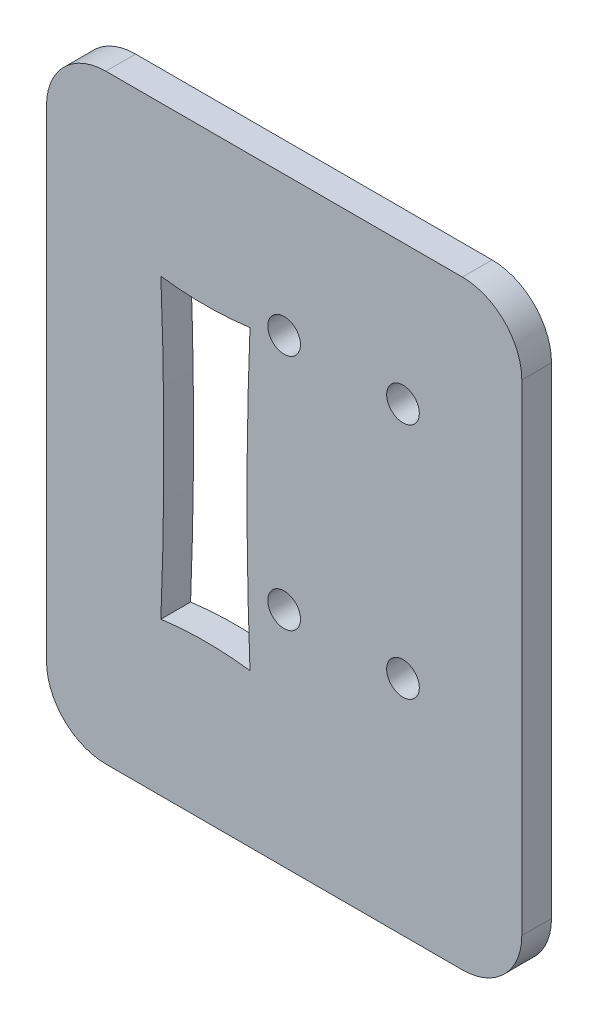
ISO-10303-21;
HEADER;
FILE_DESCRIPTION(('STEP AP214'),'2;1');
FILE_NAME('part.step','',(''),(''),'','','');
FILE_SCHEMA(('AUTOMOTIVE_DESIGN { 1 0 10303 214 1 1 1 1 }'));
ENDSEC;
DATA;
#1=APPLICATION_CONTEXT('core data for automotive mechanical design processes');
#2=APPLICATION_PROTOCOL_DEFINITION('international standard','automotive_design',2000,#1);
#3=PRODUCT_CONTEXT('',#1,'mechanical');
#4=PRODUCT('Part','Part','',(#3));
#5=PRODUCT_RELATED_PRODUCT_CATEGORY('part','',(#4));
#6=PRODUCT_DEFINITION_FORMATION('','',#4);
#7=PRODUCT_DEFINITION_CONTEXT('part definition',#1,'design');
#8=PRODUCT_DEFINITION('design','',#6,#7);
#9=PRODUCT_DEFINITION_SHAPE('','',#8);
#10=(LENGTH_UNIT() NAMED_UNIT(*) SI_UNIT(.MILLI.,.METRE.));
#11=(NAMED_UNIT(*) PLANE_ANGLE_UNIT() SI_UNIT($,.RADIAN.));
#12=(NAMED_UNIT(*) SI_UNIT($,.STERADIAN.) SOLID_ANGLE_UNIT());
#13=UNCERTAINTY_MEASURE_WITH_UNIT(LENGTH_MEASURE(1.E-05),#10,'distance_accuracy_value','');
#14=(GEOMETRIC_REPRESENTATION_CONTEXT(3) GLOBAL_UNCERTAINTY_ASSIGNED_CONTEXT((#13)) GLOBAL_UNIT_ASSIGNED_CONTEXT((#10,
#11,#12)) REPRESENTATION_CONTEXT('',''));
#15=CARTESIAN_POINT('',(0.,0.,0.));
#16=DIRECTION('',(0.,0.,1.));
#17=DIRECTION('',(1.,0.,0.));
#18=AXIS2_PLACEMENT_3D('',#15,#16,#17);
#19=CARTESIAN_POINT('',(0.,0.,2.));
#20=DIRECTION('',(0.,0.,1.));
#21=DIRECTION('',(1.,0.,0.));
#22=AXIS2_PLACEMENT_3D('',#19,#20,#21);
#23=PLANE('',#22);
#24=CARTESIAN_POINT('',(16.,31.,2.));
#25=DIRECTION('',(0.,0.,1.));
#26=DIRECTION('',(1.,0.,0.));
#27=AXIS2_PLACEMENT_3D('',#24,#25,#26);
#28=CIRCLE('',#27,1.1);
#29=CARTESIAN_POINT('',(17.1,31.,2.));
#30=VERTEX_POINT('',#29);
#31=EDGE_CURVE('E350',#30,#30,#28,.T.);
#32=ORIENTED_EDGE('',*,*,#31,.F.);
#33=EDGE_LOOP('',(#32));
#34=FACE_BOUND('',#33,.T.);
#35=CARTESIAN_POINT('',(24.,31.,2.));
#36=DIRECTION('',(0.,0.,1.));
#37=DIRECTION('',(1.,0.,0.));
#38=AXIS2_PLACEMENT_3D('',#35,#36,#37);
#39=CIRCLE('',#38,1.1);
#40=CARTESIAN_POINT('',(25.1,31.,2.));
#41=VERTEX_POINT('',#40);
#42=EDGE_CURVE('E308',#41,#41,#39,.T.);
#43=ORIENTED_EDGE('',*,*,#42,.F.);
#44=EDGE_LOOP('',(#43));
#45=FACE_BOUND('',#44,.T.);
#46=DIRECTION('',(0.,-1.,0.));
#47=VECTOR('',#46,1.);
#48=CARTESIAN_POINT('',(0.,0.,2.));
#49=LINE('',#48,#47);
#50=CARTESIAN_POINT('',(0.,36.4,2.));
#51=VERTEX_POINT('',#50);
#52=CARTESIAN_POINT('',(0.,4.,2.));
#53=VERTEX_POINT('',#52);
#54=EDGE_CURVE('E243',#51,#53,#49,.T.);
#55=ORIENTED_EDGE('',*,*,#54,.T.);
#56=CARTESIAN_POINT('',(4.,4.,2.));
#57=DIRECTION('',(0.,0.,1.));
#58=DIRECTION('',(1.,0.,0.));
#59=AXIS2_PLACEMENT_3D('',#56,#57,#58);
#60=CIRCLE('',#59,4.);
#61=CARTESIAN_POINT('',(4.,0.,2.));
#62=VERTEX_POINT('',#61);
#63=EDGE_CURVE('E216',#53,#62,#60,.T.);
#64=ORIENTED_EDGE('',*,*,#63,.T.);
#65=DIRECTION('',(1.,0.,0.));
#66=VECTOR('',#65,1.);
#67=CARTESIAN_POINT('',(0.,0.,2.));
#68=LINE('',#67,#66);
#69=CARTESIAN_POINT('',(28.,0.,2.));
#70=VERTEX_POINT('',#69);
#71=EDGE_CURVE('E272',#62,#70,#68,.T.);
#72=ORIENTED_EDGE('',*,*,#71,.T.);
#73=CARTESIAN_POINT('',(28.,4.,2.));
#74=DIRECTION('',(0.,0.,1.));
#75=DIRECTION('',(1.,0.,0.));
#76=AXIS2_PLACEMENT_3D('',#73,#74,#75);
#77=CIRCLE('',#76,4.);
#78=CARTESIAN_POINT('',(32.,4.,2.));
#79=VERTEX_POINT('',#78);
#80=EDGE_CURVE('E213',#70,#79,#77,.T.);
#81=ORIENTED_EDGE('',*,*,#80,.T.);
#82=DIRECTION('',(0.,1.,0.));
#83=VECTOR('',#82,1.);
#84=CARTESIAN_POINT('',(32.,0.,2.));
#85=LINE('',#84,#83);
#86=CARTESIAN_POINT('',(32.,36.4,2.));
#87=VERTEX_POINT('',#86);
#88=EDGE_CURVE('E231',#79,#87,#85,.T.);
#89=ORIENTED_EDGE('',*,*,#88,.T.);
#90=CARTESIAN_POINT('',(28.,36.4,2.));
#91=DIRECTION('',(0.,0.,1.));
#92=DIRECTION('',(1.,0.,0.));
#93=AXIS2_PLACEMENT_3D('',#90,#91,#92);
#94=CIRCLE('',#93,4.);
#95=CARTESIAN_POINT('',(28.,40.4,2.));
#96=VERTEX_POINT('',#95);
#97=EDGE_CURVE('E53',#87,#96,#94,.T.);
#98=ORIENTED_EDGE('',*,*,#97,.T.);
#99=DIRECTION('',(-1.,0.,0.));
#100=VECTOR('',#99,1.);
#101=CARTESIAN_POINT('',(32.,40.4,2.));
#102=LINE('',#101,#100);
#103=CARTESIAN_POINT('',(3.99999999999999,40.4,2.));
#104=VERTEX_POINT('',#103);
#105=EDGE_CURVE('E251',#96,#104,#102,.T.);
#106=ORIENTED_EDGE('',*,*,#105,.T.);
#107=CARTESIAN_POINT('',(3.99999999999999,36.4,2.));
#108=DIRECTION('',(0.,0.,1.));
#109=DIRECTION('',(1.,0.,0.));
#110=AXIS2_PLACEMENT_3D('',#107,#108,#109);
#111=CIRCLE('',#110,4.);
#112=EDGE_CURVE('E214',#104,#51,#111,.T.);
#113=ORIENTED_EDGE('',*,*,#112,.T.);
#114=EDGE_LOOP('',(#55,#64,#72,#81,#89,#98,#106,#113));
#115=FACE_BOUND('',#114,.T.);
#116=CARTESIAN_POINT('',(13.7,10.3,2.));
#117=CARTESIAN_POINT('',(13.3,20.3,2.));
#118=CARTESIAN_POINT('',(13.7,30.3,2.));
#119=B_SPLINE_CURVE_WITH_KNOTS('',2,(#116,#117,#118),.UNSPECIFIED.,.F.,.F.,(3,3),(0.,1.),.UNSPECIFIED.);
#120=CARTESIAN_POINT('',(13.7,10.3,2.));
#121=VERTEX_POINT('',#120);
#122=CARTESIAN_POINT('',(13.7,30.3,2.));
#123=VERTEX_POINT('',#122);
#124=EDGE_CURVE('E133',#121,#123,#119,.T.);
#125=ORIENTED_EDGE('',*,*,#124,.F.);
#126=CARTESIAN_POINT('',(7.7,10.3,2.));
#127=CARTESIAN_POINT('',(10.7,10.7,2.));
#128=CARTESIAN_POINT('',(13.7,10.3,2.));
#129=B_SPLINE_CURVE_WITH_KNOTS('',2,(#126,#127,#128),.UNSPECIFIED.,.F.,.F.,(3,3),(0.,1.),.UNSPECIFIED.);
#130=CARTESIAN_POINT('',(7.7,10.3,2.));
#131=VERTEX_POINT('',#130);
#132=EDGE_CURVE('E123',#131,#121,#129,.T.);
#133=ORIENTED_EDGE('',*,*,#132,.F.);
#134=CARTESIAN_POINT('',(7.7,30.3,2.));
#135=CARTESIAN_POINT('',(8.1,20.3,2.));
#136=CARTESIAN_POINT('',(7.7,10.3,2.));
#137=B_SPLINE_CURVE_WITH_KNOTS('',2,(#134,#135,#136),.UNSPECIFIED.,.F.,.F.,(3,3),(0.,1.),.UNSPECIFIED.);
#138=CARTESIAN_POINT('',(7.7,30.3,2.));
#139=VERTEX_POINT('',#138);
#140=EDGE_CURVE('E149',#139,#131,#137,.T.);
#141=ORIENTED_EDGE('',*,*,#140,.F.);
#142=CARTESIAN_POINT('',(13.7,30.3,2.));
#143=CARTESIAN_POINT('',(10.7,29.9,2.));
#144=CARTESIAN_POINT('',(7.7,30.3,2.));
#145=B_SPLINE_CURVE_WITH_KNOTS('',2,(#142,#143,#144),.UNSPECIFIED.,.F.,.F.,(3,3),(0.,1.),.UNSPECIFIED.);
#146=EDGE_CURVE('E147',#123,#139,#145,.T.);
#147=ORIENTED_EDGE('',*,*,#146,.F.);
#148=EDGE_LOOP('',(#125,#133,#141,#147));
#149=FACE_BOUND('',#148,.T.);
#150=CARTESIAN_POINT('',(24.,15.,2.));
#151=DIRECTION('',(0.,0.,1.));
#152=DIRECTION('',(1.,0.,0.));
#153=AXIS2_PLACEMENT_3D('',#150,#151,#152);
#154=CIRCLE('',#153,1.1);
#155=CARTESIAN_POINT('',(25.1,15.,2.));
#156=VERTEX_POINT('',#155);
#157=EDGE_CURVE('E356',#156,#156,#154,.T.);
#158=ORIENTED_EDGE('',*,*,#157,.F.);
#159=EDGE_LOOP('',(#158));
#160=FACE_BOUND('',#159,.T.);
#161=CARTESIAN_POINT('',(16.,15.,2.));
#162=DIRECTION('',(0.,0.,1.));
#163=DIRECTION('',(1.,0.,0.));
#164=AXIS2_PLACEMENT_3D('',#161,#162,#163);
#165=CIRCLE('',#164,1.1);
#166=CARTESIAN_POINT('',(17.1,15.,2.));
#167=VERTEX_POINT('',#166);
#168=EDGE_CURVE('E341',#167,#167,#165,.T.);
#169=ORIENTED_EDGE('',*,*,#168,.F.);
#170=EDGE_LOOP('',(#169));
#171=FACE_BOUND('',#170,.T.);
#172=ADVANCED_FACE('F32',(#34,#45,#115,#149,#160,#171),#23,.T.);
#173=CARTESIAN_POINT('',(0.,0.,0.));
#174=DIRECTION('',(0.,0.,1.));
#175=DIRECTION('',(1.,0.,0.));
#176=AXIS2_PLACEMENT_3D('',#173,#174,#175);
#177=PLANE('',#176);
#178=CARTESIAN_POINT('',(16.,31.,0.));
#179=DIRECTION('',(0.,0.,1.));
#180=DIRECTION('',(1.,0.,0.));
#181=AXIS2_PLACEMENT_3D('',#178,#179,#180);
#182=CIRCLE('',#181,1.1);
#183=CARTESIAN_POINT('',(17.1,31.,0.));
#184=VERTEX_POINT('',#183);
#185=EDGE_CURVE('E347',#184,#184,#182,.T.);
#186=ORIENTED_EDGE('',*,*,#185,.T.);
#187=EDGE_LOOP('',(#186));
#188=FACE_BOUND('',#187,.T.);
#189=CARTESIAN_POINT('',(24.,31.,0.));
#190=DIRECTION('',(0.,0.,1.));
#191=DIRECTION('',(1.,0.,0.));
#192=AXIS2_PLACEMENT_3D('',#189,#190,#191);
#193=CIRCLE('',#192,1.1);
#194=CARTESIAN_POINT('',(25.1,31.,0.));
#195=VERTEX_POINT('',#194);
#196=EDGE_CURVE('E359',#195,#195,#193,.T.);
#197=ORIENTED_EDGE('',*,*,#196,.T.);
#198=EDGE_LOOP('',(#197));
#199=FACE_BOUND('',#198,.T.);
#200=DIRECTION('',(1.,0.,0.));
#201=VECTOR('',#200,1.);
#202=CARTESIAN_POINT('',(0.,0.,0.));
#203=LINE('',#202,#201);
#204=CARTESIAN_POINT('',(4.,0.,0.));
#205=VERTEX_POINT('',#204);
#206=CARTESIAN_POINT('',(28.,0.,0.));
#207=VERTEX_POINT('',#206);
#208=EDGE_CURVE('E241',#205,#207,#203,.T.);
#209=ORIENTED_EDGE('',*,*,#208,.F.);
#210=CARTESIAN_POINT('',(4.,4.,0.));
#211=DIRECTION('',(0.,0.,1.));
#212=DIRECTION('',(1.,0.,0.));
#213=AXIS2_PLACEMENT_3D('',#210,#211,#212);
#214=CIRCLE('',#213,4.);
#215=CARTESIAN_POINT('',(0.,4.,0.));
#216=VERTEX_POINT('',#215);
#217=EDGE_CURVE('E258',#205,#216,#214,.F.);
#218=ORIENTED_EDGE('',*,*,#217,.T.);
#219=DIRECTION('',(0.,-1.,0.));
#220=VECTOR('',#219,1.);
#221=CARTESIAN_POINT('',(0.,0.,0.));
#222=LINE('',#221,#220);
#223=CARTESIAN_POINT('',(0.,36.4,0.));
#224=VERTEX_POINT('',#223);
#225=EDGE_CURVE('E141',#224,#216,#222,.T.);
#226=ORIENTED_EDGE('',*,*,#225,.F.);
#227=CARTESIAN_POINT('',(3.99999999999999,36.4,0.));
#228=DIRECTION('',(0.,0.,1.));
#229=DIRECTION('',(1.,0.,0.));
#230=AXIS2_PLACEMENT_3D('',#227,#228,#229);
#231=CIRCLE('',#230,4.);
#232=CARTESIAN_POINT('',(3.99999999999999,40.4,0.));
#233=VERTEX_POINT('',#232);
#234=EDGE_CURVE('E254',#224,#233,#231,.F.);
#235=ORIENTED_EDGE('',*,*,#234,.T.);
#236=DIRECTION('',(-1.,0.,0.));
#237=VECTOR('',#236,1.);
#238=CARTESIAN_POINT('',(32.,40.4,0.));
#239=LINE('',#238,#237);
#240=CARTESIAN_POINT('',(28.,40.4,0.));
#241=VERTEX_POINT('',#240);
#242=EDGE_CURVE('E240',#241,#233,#239,.T.);
#243=ORIENTED_EDGE('',*,*,#242,.F.);
#244=CARTESIAN_POINT('',(28.,36.4,0.));
#245=DIRECTION('',(0.,0.,1.));
#246=DIRECTION('',(1.,0.,0.));
#247=AXIS2_PLACEMENT_3D('',#244,#245,#246);
#248=CIRCLE('',#247,4.);
#249=CARTESIAN_POINT('',(32.,36.4,0.));
#250=VERTEX_POINT('',#249);
#251=EDGE_CURVE('E239',#241,#250,#248,.F.);
#252=ORIENTED_EDGE('',*,*,#251,.T.);
#253=DIRECTION('',(0.,1.,0.));
#254=VECTOR('',#253,1.);
#255=CARTESIAN_POINT('',(32.,0.,0.));
#256=LINE('',#255,#254);
#257=CARTESIAN_POINT('',(32.,4.,0.));
#258=VERTEX_POINT('',#257);
#259=EDGE_CURVE('E230',#258,#250,#256,.T.);
#260=ORIENTED_EDGE('',*,*,#259,.F.);
#261=CARTESIAN_POINT('',(28.,4.,0.));
#262=DIRECTION('',(0.,0.,1.));
#263=DIRECTION('',(1.,0.,0.));
#264=AXIS2_PLACEMENT_3D('',#261,#262,#263);
#265=CIRCLE('',#264,4.);
#266=EDGE_CURVE('E236',#258,#207,#265,.F.);
#267=ORIENTED_EDGE('',*,*,#266,.T.);
#268=EDGE_LOOP('',(#209,#218,#226,#235,#243,#252,#260,#267));
#269=FACE_BOUND('',#268,.T.);
#270=CARTESIAN_POINT('',(7.7,10.3,0.));
#271=CARTESIAN_POINT('',(10.7,10.7,0.));
#272=CARTESIAN_POINT('',(13.7,10.3,0.));
#273=B_SPLINE_CURVE_WITH_KNOTS('',2,(#270,#271,#272),.UNSPECIFIED.,.F.,.F.,(3,3),(0.,1.),.UNSPECIFIED.);
#274=CARTESIAN_POINT('',(7.7,10.3,0.));
#275=VERTEX_POINT('',#274);
#276=CARTESIAN_POINT('',(13.7,10.3,0.));
#277=VERTEX_POINT('',#276);
#278=EDGE_CURVE('E302',#275,#277,#273,.T.);
#279=ORIENTED_EDGE('',*,*,#278,.T.);
#280=CARTESIAN_POINT('',(13.7,10.3,0.));
#281=CARTESIAN_POINT('',(13.3,20.3,0.));
#282=CARTESIAN_POINT('',(13.7,30.3,0.));
#283=B_SPLINE_CURVE_WITH_KNOTS('',2,(#280,#281,#282),.UNSPECIFIED.,.F.,.F.,(3,3),(0.,1.),.UNSPECIFIED.);
#284=CARTESIAN_POINT('',(13.7,30.3,0.));
#285=VERTEX_POINT('',#284);
#286=EDGE_CURVE('E140',#277,#285,#283,.T.);
#287=ORIENTED_EDGE('',*,*,#286,.T.);
#288=CARTESIAN_POINT('',(13.7,30.3,0.));
#289=CARTESIAN_POINT('',(10.7,29.9,0.));
#290=CARTESIAN_POINT('',(7.7,30.3,0.));
#291=B_SPLINE_CURVE_WITH_KNOTS('',2,(#288,#289,#290),.UNSPECIFIED.,.F.,.F.,(3,3),(0.,1.),.UNSPECIFIED.);
#292=CARTESIAN_POINT('',(7.7,30.3,0.));
#293=VERTEX_POINT('',#292);
#294=EDGE_CURVE('E288',#285,#293,#291,.T.);
#295=ORIENTED_EDGE('',*,*,#294,.T.);
#296=CARTESIAN_POINT('',(7.7,30.3,0.));
#297=CARTESIAN_POINT('',(8.1,20.3,0.));
#298=CARTESIAN_POINT('',(7.7,10.3,0.));
#299=B_SPLINE_CURVE_WITH_KNOTS('',2,(#296,#297,#298),.UNSPECIFIED.,.F.,.F.,(3,3),(0.,1.),.UNSPECIFIED.);
#300=EDGE_CURVE('E134',#293,#275,#299,.T.);
#301=ORIENTED_EDGE('',*,*,#300,.T.);
#302=EDGE_LOOP('',(#279,#287,#295,#301));
#303=FACE_BOUND('',#302,.T.);
#304=CARTESIAN_POINT('',(24.,15.,0.));
#305=DIRECTION('',(0.,0.,1.));
#306=DIRECTION('',(1.,0.,0.));
#307=AXIS2_PLACEMENT_3D('',#304,#305,#306);
#308=CIRCLE('',#307,1.1);
#309=CARTESIAN_POINT('',(25.1,15.,0.));
#310=VERTEX_POINT('',#309);
#311=EDGE_CURVE('E353',#310,#310,#308,.T.);
#312=ORIENTED_EDGE('',*,*,#311,.T.);
#313=EDGE_LOOP('',(#312));
#314=FACE_BOUND('',#313,.T.);
#315=CARTESIAN_POINT('',(16.,15.,0.));
#316=DIRECTION('',(0.,0.,1.));
#317=DIRECTION('',(1.,0.,0.));
#318=AXIS2_PLACEMENT_3D('',#315,#316,#317);
#319=CIRCLE('',#318,1.1);
#320=CARTESIAN_POINT('',(17.1,15.,0.));
#321=VERTEX_POINT('',#320);
#322=EDGE_CURVE('E344',#321,#321,#319,.T.);
#323=ORIENTED_EDGE('',*,*,#322,.T.);
#324=EDGE_LOOP('',(#323));
#325=FACE_BOUND('',#324,.T.);
#326=ADVANCED_FACE('F176',(#188,#199,#269,#303,#314,#325),#177,.F.);
#327=CARTESIAN_POINT('',(0.,0.,2.));
#328=DIRECTION('',(1.,0.,0.));
#329=DIRECTION('',(0.,1.,0.));
#330=AXIS2_PLACEMENT_3D('',#327,#328,#329);
#331=PLANE('',#330);
#332=ORIENTED_EDGE('',*,*,#225,.T.);
#333=DIRECTION('',(0.,0.,-1.));
#334=VECTOR('',#333,1.);
#335=CARTESIAN_POINT('',(0.,4.,2.));
#336=LINE('',#335,#334);
#337=EDGE_CURVE('E218',#216,#53,#336,.F.);
#338=ORIENTED_EDGE('',*,*,#337,.T.);
#339=ORIENTED_EDGE('',*,*,#54,.F.);
#340=DIRECTION('',(0.,0.,-1.));
#341=VECTOR('',#340,1.);
#342=CARTESIAN_POINT('',(0.,36.4,2.));
#343=LINE('',#342,#341);
#344=EDGE_CURVE('E260',#51,#224,#343,.T.);
#345=ORIENTED_EDGE('',*,*,#344,.T.);
#346=EDGE_LOOP('',(#332,#338,#339,#345));
#347=FACE_BOUND('',#346,.T.);
#348=ADVANCED_FACE('F180',(#347),#331,.F.);
#349=CARTESIAN_POINT('',(0.,0.,2.));
#350=DIRECTION('',(0.,1.,0.));
#351=DIRECTION('',(0.,0.,1.));
#352=AXIS2_PLACEMENT_3D('',#349,#350,#351);
#353=PLANE('',#352);
#354=ORIENTED_EDGE('',*,*,#71,.F.);
#355=DIRECTION('',(0.,0.,-1.));
#356=VECTOR('',#355,1.);
#357=CARTESIAN_POINT('',(4.,0.,2.));
#358=LINE('',#357,#356);
#359=EDGE_CURVE('E250',#62,#205,#358,.T.);
#360=ORIENTED_EDGE('',*,*,#359,.T.);
#361=ORIENTED_EDGE('',*,*,#208,.T.);
#362=DIRECTION('',(0.,0.,-1.));
#363=VECTOR('',#362,1.);
#364=CARTESIAN_POINT('',(28.,0.,2.));
#365=LINE('',#364,#363);
#366=EDGE_CURVE('E248',#207,#70,#365,.F.);
#367=ORIENTED_EDGE('',*,*,#366,.T.);
#368=EDGE_LOOP('',(#354,#360,#361,#367));
#369=FACE_BOUND('',#368,.T.);
#370=ADVANCED_FACE('F187',(#369),#353,.F.);
#371=CARTESIAN_POINT('',(32.,0.,2.));
#372=DIRECTION('',(-1.,0.,0.));
#373=DIRECTION('',(0.,-1.,0.));
#374=AXIS2_PLACEMENT_3D('',#371,#372,#373);
#375=PLANE('',#374);
#376=ORIENTED_EDGE('',*,*,#88,.F.);
#377=DIRECTION('',(0.,0.,-1.));
#378=VECTOR('',#377,1.);
#379=CARTESIAN_POINT('',(32.,4.,2.));
#380=LINE('',#379,#378);
#381=EDGE_CURVE('E224',#79,#258,#380,.T.);
#382=ORIENTED_EDGE('',*,*,#381,.T.);
#383=ORIENTED_EDGE('',*,*,#259,.T.);
#384=DIRECTION('',(0.,0.,-1.));
#385=VECTOR('',#384,1.);
#386=CARTESIAN_POINT('',(32.,36.4,2.));
#387=LINE('',#386,#385);
#388=EDGE_CURVE('E212',#250,#87,#387,.F.);
#389=ORIENTED_EDGE('',*,*,#388,.T.);
#390=EDGE_LOOP('',(#376,#382,#383,#389));
#391=FACE_BOUND('',#390,.T.);
#392=ADVANCED_FACE('F184',(#391),#375,.F.);
#393=CARTESIAN_POINT('',(32.,40.4,2.));
#394=DIRECTION('',(0.,-1.,0.));
#395=DIRECTION('',(0.,0.,-1.));
#396=AXIS2_PLACEMENT_3D('',#393,#394,#395);
#397=PLANE('',#396);
#398=ORIENTED_EDGE('',*,*,#105,.F.);
#399=DIRECTION('',(0.,0.,-1.));
#400=VECTOR('',#399,1.);
#401=CARTESIAN_POINT('',(28.,40.4,2.));
#402=LINE('',#401,#400);
#403=EDGE_CURVE('E11',#96,#241,#402,.T.);
#404=ORIENTED_EDGE('',*,*,#403,.T.);
#405=ORIENTED_EDGE('',*,*,#242,.T.);
#406=DIRECTION('',(0.,0.,-1.));
#407=VECTOR('',#406,1.);
#408=CARTESIAN_POINT('',(3.99999999999999,40.4,2.));
#409=LINE('',#408,#407);
#410=EDGE_CURVE('E40',#233,#104,#409,.F.);
#411=ORIENTED_EDGE('',*,*,#410,.T.);
#412=EDGE_LOOP('',(#398,#404,#405,#411));
#413=FACE_BOUND('',#412,.T.);
#414=ADVANCED_FACE('F173',(#413),#397,.F.);
#415=DIRECTION('',(0.,0.,-1.));
#416=VECTOR('',#415,1.);
#417=SURFACE_OF_LINEAR_EXTRUSION('',#129,#416);
#418=ORIENTED_EDGE('',*,*,#278,.F.);
#419=DIRECTION('',(0.,0.,-1.));
#420=VECTOR('',#419,1.);
#421=CARTESIAN_POINT('',(7.7,10.3,2.));
#422=LINE('',#421,#420);
#423=EDGE_CURVE('E129',#131,#275,#422,.T.);
#424=ORIENTED_EDGE('',*,*,#423,.F.);
#425=ORIENTED_EDGE('',*,*,#132,.T.);
#426=DIRECTION('',(0.,0.,-1.));
#427=VECTOR('',#426,1.);
#428=CARTESIAN_POINT('',(13.7,10.3,2.));
#429=LINE('',#428,#427);
#430=EDGE_CURVE('E126',#121,#277,#429,.T.);
#431=ORIENTED_EDGE('',*,*,#430,.T.);
#432=EDGE_LOOP('',(#418,#424,#425,#431));
#433=FACE_BOUND('',#432,.T.);
#434=ADVANCED_FACE('F125',(#433),#417,.T.);
#435=DIRECTION('',(0.,0.,-1.));
#436=VECTOR('',#435,1.);
#437=SURFACE_OF_LINEAR_EXTRUSION('',#119,#436);
#438=ORIENTED_EDGE('',*,*,#286,.F.);
#439=ORIENTED_EDGE('',*,*,#430,.F.);
#440=ORIENTED_EDGE('',*,*,#124,.T.);
#441=DIRECTION('',(0.,0.,-1.));
#442=VECTOR('',#441,1.);
#443=CARTESIAN_POINT('',(13.7,30.3,2.));
#444=LINE('',#443,#442);
#445=EDGE_CURVE('E142',#123,#285,#444,.T.);
#446=ORIENTED_EDGE('',*,*,#445,.T.);
#447=EDGE_LOOP('',(#438,#439,#440,#446));
#448=FACE_BOUND('',#447,.T.);
#449=ADVANCED_FACE('F137',(#448),#437,.T.);
#450=DIRECTION('',(0.,0.,-1.));
#451=VECTOR('',#450,1.);
#452=SURFACE_OF_LINEAR_EXTRUSION('',#145,#451);
#453=ORIENTED_EDGE('',*,*,#294,.F.);
#454=ORIENTED_EDGE('',*,*,#445,.F.);
#455=ORIENTED_EDGE('',*,*,#146,.T.);
#456=DIRECTION('',(0.,0.,-1.));
#457=VECTOR('',#456,1.);
#458=CARTESIAN_POINT('',(7.7,30.3,2.));
#459=LINE('',#458,#457);
#460=EDGE_CURVE('E281',#139,#293,#459,.T.);
#461=ORIENTED_EDGE('',*,*,#460,.T.);
#462=EDGE_LOOP('',(#453,#454,#455,#461));
#463=FACE_BOUND('',#462,.T.);
#464=ADVANCED_FACE('F169',(#463),#452,.T.);
#465=DIRECTION('',(0.,0.,-1.));
#466=VECTOR('',#465,1.);
#467=SURFACE_OF_LINEAR_EXTRUSION('',#137,#466);
#468=ORIENTED_EDGE('',*,*,#300,.F.);
#469=ORIENTED_EDGE('',*,*,#460,.F.);
#470=ORIENTED_EDGE('',*,*,#140,.T.);
#471=ORIENTED_EDGE('',*,*,#423,.T.);
#472=EDGE_LOOP('',(#468,#469,#470,#471));
#473=FACE_BOUND('',#472,.T.);
#474=ADVANCED_FACE('F318',(#473),#467,.T.);
#475=CARTESIAN_POINT('',(24.,31.,2.));
#476=DIRECTION('',(0.,0.,-1.));
#477=DIRECTION('',(-1.,0.,0.));
#478=AXIS2_PLACEMENT_3D('',#475,#476,#477);
#479=CYLINDRICAL_SURFACE('',#478,1.1);
#480=ORIENTED_EDGE('',*,*,#42,.T.);
#481=EDGE_LOOP('',(#480));
#482=FACE_BOUND('',#481,.T.);
#483=ORIENTED_EDGE('',*,*,#196,.F.);
#484=EDGE_LOOP('',(#483));
#485=FACE_BOUND('',#484,.T.);
#486=ADVANCED_FACE('F321',(#482,#485),#479,.F.);
#487=CARTESIAN_POINT('',(24.,15.,2.));
#488=DIRECTION('',(0.,0.,-1.));
#489=DIRECTION('',(-1.,0.,0.));
#490=AXIS2_PLACEMENT_3D('',#487,#488,#489);
#491=CYLINDRICAL_SURFACE('',#490,1.1);
#492=ORIENTED_EDGE('',*,*,#157,.T.);
#493=EDGE_LOOP('',(#492));
#494=FACE_BOUND('',#493,.T.);
#495=ORIENTED_EDGE('',*,*,#311,.F.);
#496=EDGE_LOOP('',(#495));
#497=FACE_BOUND('',#496,.T.);
#498=ADVANCED_FACE('F325',(#494,#497),#491,.F.);
#499=CARTESIAN_POINT('',(16.,31.,2.));
#500=DIRECTION('',(0.,0.,-1.));
#501=DIRECTION('',(-1.,0.,0.));
#502=AXIS2_PLACEMENT_3D('',#499,#500,#501);
#503=CYLINDRICAL_SURFACE('',#502,1.1);
#504=ORIENTED_EDGE('',*,*,#31,.T.);
#505=EDGE_LOOP('',(#504));
#506=FACE_BOUND('',#505,.T.);
#507=ORIENTED_EDGE('',*,*,#185,.F.);
#508=EDGE_LOOP('',(#507));
#509=FACE_BOUND('',#508,.T.);
#510=ADVANCED_FACE('F329',(#506,#509),#503,.F.);
#511=CARTESIAN_POINT('',(16.,15.,2.));
#512=DIRECTION('',(0.,0.,-1.));
#513=DIRECTION('',(-1.,0.,0.));
#514=AXIS2_PLACEMENT_3D('',#511,#512,#513);
#515=CYLINDRICAL_SURFACE('',#514,1.1);
#516=ORIENTED_EDGE('',*,*,#168,.T.);
#517=EDGE_LOOP('',(#516));
#518=FACE_BOUND('',#517,.T.);
#519=ORIENTED_EDGE('',*,*,#322,.F.);
#520=EDGE_LOOP('',(#519));
#521=FACE_BOUND('',#520,.T.);
#522=ADVANCED_FACE('F199',(#518,#521),#515,.F.);
#523=CARTESIAN_POINT('',(4.,4.,2.));
#524=DIRECTION('',(0.,0.,-1.));
#525=DIRECTION('',(-1.,0.,0.));
#526=AXIS2_PLACEMENT_3D('',#523,#524,#525);
#527=CYLINDRICAL_SURFACE('',#526,4.);
#528=ORIENTED_EDGE('',*,*,#63,.F.);
#529=ORIENTED_EDGE('',*,*,#337,.F.);
#530=ORIENTED_EDGE('',*,*,#217,.F.);
#531=ORIENTED_EDGE('',*,*,#359,.F.);
#532=EDGE_LOOP('',(#528,#529,#530,#531));
#533=FACE_BOUND('',#532,.T.);
#534=ADVANCED_FACE('F195',(#533),#527,.T.);
#535=CARTESIAN_POINT('',(28.,4.,2.));
#536=DIRECTION('',(0.,0.,-1.));
#537=DIRECTION('',(-1.,0.,0.));
#538=AXIS2_PLACEMENT_3D('',#535,#536,#537);
#539=CYLINDRICAL_SURFACE('',#538,4.);
#540=ORIENTED_EDGE('',*,*,#80,.F.);
#541=ORIENTED_EDGE('',*,*,#366,.F.);
#542=ORIENTED_EDGE('',*,*,#266,.F.);
#543=ORIENTED_EDGE('',*,*,#381,.F.);
#544=EDGE_LOOP('',(#540,#541,#542,#543));
#545=FACE_BOUND('',#544,.T.);
#546=ADVANCED_FACE('F198',(#545),#539,.T.);
#547=CARTESIAN_POINT('',(28.,36.4,2.));
#548=DIRECTION('',(0.,0.,-1.));
#549=DIRECTION('',(-1.,0.,0.));
#550=AXIS2_PLACEMENT_3D('',#547,#548,#549);
#551=CYLINDRICAL_SURFACE('',#550,4.);
#552=ORIENTED_EDGE('',*,*,#97,.F.);
#553=ORIENTED_EDGE('',*,*,#388,.F.);
#554=ORIENTED_EDGE('',*,*,#251,.F.);
#555=ORIENTED_EDGE('',*,*,#403,.F.);
#556=EDGE_LOOP('',(#552,#553,#554,#555));
#557=FACE_BOUND('',#556,.T.);
#558=ADVANCED_FACE('F202',(#557),#551,.T.);
#559=CARTESIAN_POINT('',(3.99999999999999,36.4,2.));
#560=DIRECTION('',(0.,0.,-1.));
#561=DIRECTION('',(-1.,0.,0.));
#562=AXIS2_PLACEMENT_3D('',#559,#560,#561);
#563=CYLINDRICAL_SURFACE('',#562,4.);
#564=ORIENTED_EDGE('',*,*,#112,.F.);
#565=ORIENTED_EDGE('',*,*,#410,.F.);
#566=ORIENTED_EDGE('',*,*,#234,.F.);
#567=ORIENTED_EDGE('',*,*,#344,.F.);
#568=EDGE_LOOP('',(#564,#565,#566,#567));
#569=FACE_BOUND('',#568,.T.);
#570=ADVANCED_FACE('F34',(#569),#563,.T.);
#571=CLOSED_SHELL('',(#172,#326,#348,#370,#392,#414,#434,#449,#464,#474,#486,#498,#510,#522,
#534,#546,#558,#570));
#572=MANIFOLD_SOLID_BREP('B2',#571);
#573=ADVANCED_BREP_SHAPE_REPRESENTATION('',(#18,#572),#14);
#574=SHAPE_DEFINITION_REPRESENTATION(#9,#573);
ENDSEC;
END-ISO-10303-21;
